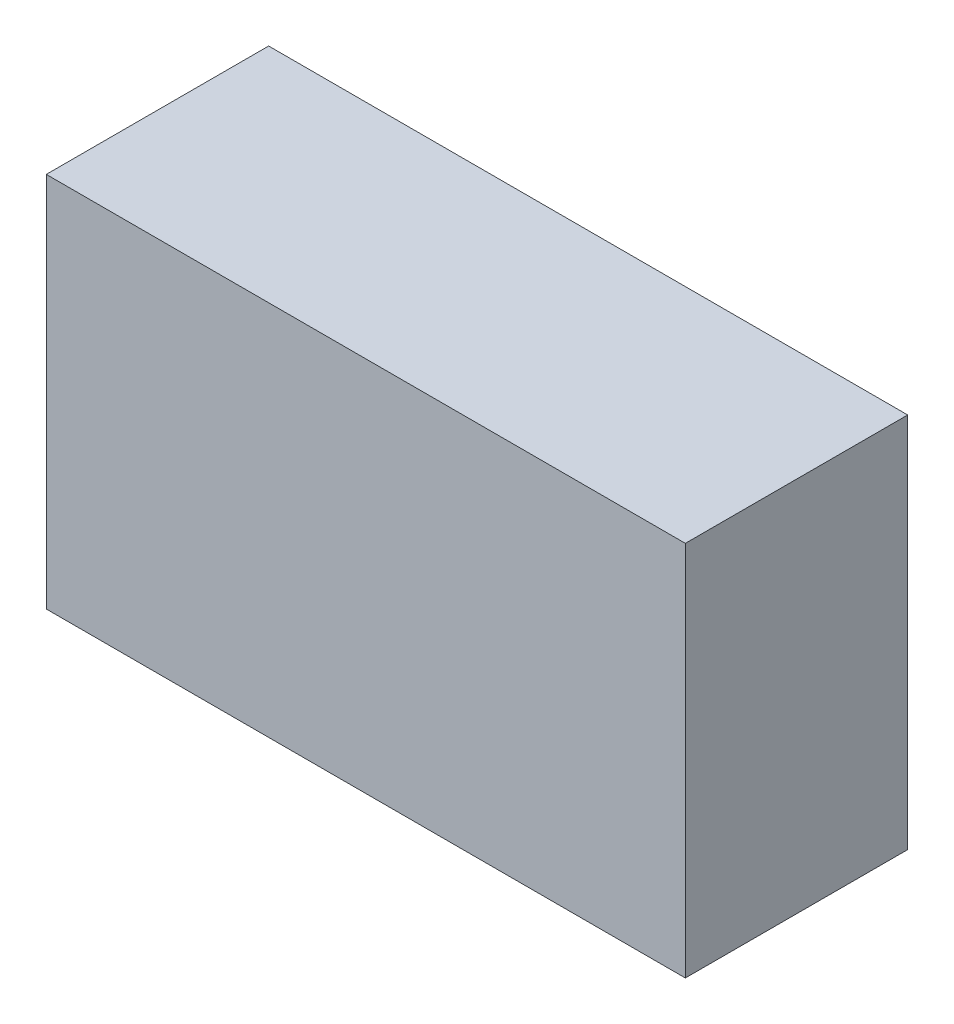
ISO-10303-21;
HEADER;
FILE_DESCRIPTION(('STEP AP214'),'2;1');
FILE_NAME('part.step','',(''),(''),'','','');
FILE_SCHEMA(('AUTOMOTIVE_DESIGN { 1 0 10303 214 1 1 1 1 }'));
ENDSEC;
DATA;
#1=APPLICATION_CONTEXT('core data for automotive mechanical design processes');
#2=APPLICATION_PROTOCOL_DEFINITION('international standard','automotive_design',2000,#1);
#3=PRODUCT_CONTEXT('',#1,'mechanical');
#4=PRODUCT('Part','Part','',(#3));
#5=PRODUCT_RELATED_PRODUCT_CATEGORY('part','',(#4));
#6=PRODUCT_DEFINITION_FORMATION('','',#4);
#7=PRODUCT_DEFINITION_CONTEXT('part definition',#1,'design');
#8=PRODUCT_DEFINITION('design','',#6,#7);
#9=PRODUCT_DEFINITION_SHAPE('','',#8);
#10=(LENGTH_UNIT() NAMED_UNIT(*) SI_UNIT(.MILLI.,.METRE.));
#11=(NAMED_UNIT(*) PLANE_ANGLE_UNIT() SI_UNIT($,.RADIAN.));
#12=(NAMED_UNIT(*) SI_UNIT($,.STERADIAN.) SOLID_ANGLE_UNIT());
#13=UNCERTAINTY_MEASURE_WITH_UNIT(LENGTH_MEASURE(1.E-05),#10,'distance_accuracy_value','');
#14=(GEOMETRIC_REPRESENTATION_CONTEXT(3) GLOBAL_UNCERTAINTY_ASSIGNED_CONTEXT((#13)) GLOBAL_UNIT_ASSIGNED_CONTEXT((#10,
#11,#12)) REPRESENTATION_CONTEXT('',''));
#15=CARTESIAN_POINT('',(0.,0.,0.));
#16=DIRECTION('',(0.,0.,1.));
#17=DIRECTION('',(1.,0.,0.));
#18=AXIS2_PLACEMENT_3D('',#15,#16,#17);
#19=CARTESIAN_POINT('',(-0.364998,0.21500084,0.));
#20=DIRECTION('',(1.,0.,0.));
#21=DIRECTION('',(0.,-1.,0.));
#22=AXIS2_PLACEMENT_3D('',#19,#20,#21);
#23=PLANE('',#22);
#24=DIRECTION('',(0.,-1.,0.));
#25=VECTOR('',#24,1.);
#26=CARTESIAN_POINT('',(-0.364998,0.21500084,0.));
#27=LINE('',#26,#25);
#28=CARTESIAN_POINT('',(-0.364998,0.21500084,0.));
#29=VERTEX_POINT('',#28);
#30=CARTESIAN_POINT('',(-0.364998,-0.21500084,0.));
#31=VERTEX_POINT('',#30);
#32=EDGE_CURVE('E11',#29,#31,#27,.T.);
#33=ORIENTED_EDGE('',*,*,#32,.T.);
#34=DIRECTION('',(0.,0.,1.));
#35=VECTOR('',#34,1.);
#36=CARTESIAN_POINT('',(-0.364998,-0.21500084,0.));
#37=LINE('',#36,#35);
#38=CARTESIAN_POINT('',(-0.364998,-0.21500084,0.254));
#39=VERTEX_POINT('',#38);
#40=EDGE_CURVE('E24',#31,#39,#37,.T.);
#41=ORIENTED_EDGE('',*,*,#40,.T.);
#42=DIRECTION('',(0.,-1.,0.));
#43=VECTOR('',#42,1.);
#44=CARTESIAN_POINT('',(-0.364998,0.21500084,0.254));
#45=LINE('',#44,#43);
#46=CARTESIAN_POINT('',(-0.364998,0.21500084,0.254));
#47=VERTEX_POINT('',#46);
#48=EDGE_CURVE('E87',#47,#39,#45,.T.);
#49=ORIENTED_EDGE('',*,*,#48,.F.);
#50=DIRECTION('',(0.,0.,1.));
#51=VECTOR('',#50,1.);
#52=CARTESIAN_POINT('',(-0.364998,0.21500084,0.));
#53=LINE('',#52,#51);
#54=EDGE_CURVE('E36',#29,#47,#53,.T.);
#55=ORIENTED_EDGE('',*,*,#54,.F.);
#56=EDGE_LOOP('',(#33,#41,#49,#55));
#57=FACE_BOUND('',#56,.T.);
#58=ADVANCED_FACE('F17',(#57),#23,.F.);
#59=CARTESIAN_POINT('',(-0.364998,-0.21500084,0.));
#60=DIRECTION('',(0.,1.,0.));
#61=DIRECTION('',(1.,0.,0.));
#62=AXIS2_PLACEMENT_3D('',#59,#60,#61);
#63=PLANE('',#62);
#64=DIRECTION('',(1.,0.,0.));
#65=VECTOR('',#64,1.);
#66=CARTESIAN_POINT('',(-0.364998,-0.21500084,0.));
#67=LINE('',#66,#65);
#68=CARTESIAN_POINT('',(0.36500054,-0.21500084,0.));
#69=VERTEX_POINT('',#68);
#70=EDGE_CURVE('E84',#31,#69,#67,.T.);
#71=ORIENTED_EDGE('',*,*,#70,.T.);
#72=DIRECTION('',(0.,0.,1.));
#73=VECTOR('',#72,1.);
#74=CARTESIAN_POINT('',(0.36500054,-0.21500084,0.));
#75=LINE('',#74,#73);
#76=CARTESIAN_POINT('',(0.36500054,-0.21500084,0.254));
#77=VERTEX_POINT('',#76);
#78=EDGE_CURVE('E82',#69,#77,#75,.T.);
#79=ORIENTED_EDGE('',*,*,#78,.T.);
#80=DIRECTION('',(1.,0.,0.));
#81=VECTOR('',#80,1.);
#82=CARTESIAN_POINT('',(-0.364998,-0.21500084,0.254));
#83=LINE('',#82,#81);
#84=EDGE_CURVE('E62',#39,#77,#83,.T.);
#85=ORIENTED_EDGE('',*,*,#84,.F.);
#86=ORIENTED_EDGE('',*,*,#40,.F.);
#87=EDGE_LOOP('',(#71,#79,#85,#86));
#88=FACE_BOUND('',#87,.T.);
#89=ADVANCED_FACE('F89',(#88),#63,.F.);
#90=CARTESIAN_POINT('',(0.36500054,-0.21500084,0.));
#91=DIRECTION('',(-1.,0.,0.));
#92=DIRECTION('',(0.,1.,0.));
#93=AXIS2_PLACEMENT_3D('',#90,#91,#92);
#94=PLANE('',#93);
#95=DIRECTION('',(0.,1.,0.));
#96=VECTOR('',#95,1.);
#97=CARTESIAN_POINT('',(0.36500054,-0.21500084,0.));
#98=LINE('',#97,#96);
#99=CARTESIAN_POINT('',(0.36500054,0.21500084,0.));
#100=VERTEX_POINT('',#99);
#101=EDGE_CURVE('E71',#69,#100,#98,.T.);
#102=ORIENTED_EDGE('',*,*,#101,.T.);
#103=DIRECTION('',(0.,0.,1.));
#104=VECTOR('',#103,1.);
#105=CARTESIAN_POINT('',(0.36500054,0.21500084,0.));
#106=LINE('',#105,#104);
#107=CARTESIAN_POINT('',(0.36500054,0.21500084,0.254));
#108=VERTEX_POINT('',#107);
#109=EDGE_CURVE('E65',#100,#108,#106,.T.);
#110=ORIENTED_EDGE('',*,*,#109,.T.);
#111=DIRECTION('',(0.,1.,0.));
#112=VECTOR('',#111,1.);
#113=CARTESIAN_POINT('',(0.36500054,-0.21500084,0.254));
#114=LINE('',#113,#112);
#115=EDGE_CURVE('E57',#77,#108,#114,.T.);
#116=ORIENTED_EDGE('',*,*,#115,.F.);
#117=ORIENTED_EDGE('',*,*,#78,.F.);
#118=EDGE_LOOP('',(#102,#110,#116,#117));
#119=FACE_BOUND('',#118,.T.);
#120=ADVANCED_FACE('F69',(#119),#94,.F.);
#121=CARTESIAN_POINT('',(0.36500054,0.21500084,0.));
#122=DIRECTION('',(0.,-1.,0.));
#123=DIRECTION('',(-1.,0.,0.));
#124=AXIS2_PLACEMENT_3D('',#121,#122,#123);
#125=PLANE('',#124);
#126=DIRECTION('',(-1.,0.,0.));
#127=VECTOR('',#126,1.);
#128=CARTESIAN_POINT('',(0.36500054,0.21500084,0.));
#129=LINE('',#128,#127);
#130=EDGE_CURVE('E66',#100,#29,#129,.T.);
#131=ORIENTED_EDGE('',*,*,#130,.T.);
#132=ORIENTED_EDGE('',*,*,#54,.T.);
#133=DIRECTION('',(-1.,0.,0.));
#134=VECTOR('',#133,1.);
#135=CARTESIAN_POINT('',(0.36500054,0.21500084,0.254));
#136=LINE('',#135,#134);
#137=EDGE_CURVE('E61',#108,#47,#136,.T.);
#138=ORIENTED_EDGE('',*,*,#137,.F.);
#139=ORIENTED_EDGE('',*,*,#109,.F.);
#140=EDGE_LOOP('',(#131,#132,#138,#139));
#141=FACE_BOUND('',#140,.T.);
#142=ADVANCED_FACE('F76',(#141),#125,.F.);
#143=CARTESIAN_POINT('',(-0.364998,0.21500084,0.));
#144=DIRECTION('',(0.,0.,-1.));
#145=DIRECTION('',(-1.,0.,0.));
#146=AXIS2_PLACEMENT_3D('',#143,#144,#145);
#147=PLANE('',#146);
#148=ORIENTED_EDGE('',*,*,#130,.F.);
#149=ORIENTED_EDGE('',*,*,#101,.F.);
#150=ORIENTED_EDGE('',*,*,#70,.F.);
#151=ORIENTED_EDGE('',*,*,#32,.F.);
#152=EDGE_LOOP('',(#148,#149,#150,#151));
#153=FACE_BOUND('',#152,.T.);
#154=ADVANCED_FACE('F91',(#153),#147,.T.);
#155=CARTESIAN_POINT('',(-0.364998,0.21500084,0.254));
#156=DIRECTION('',(0.,0.,-1.));
#157=DIRECTION('',(-1.,0.,0.));
#158=AXIS2_PLACEMENT_3D('',#155,#156,#157);
#159=PLANE('',#158);
#160=ORIENTED_EDGE('',*,*,#48,.T.);
#161=ORIENTED_EDGE('',*,*,#84,.T.);
#162=ORIENTED_EDGE('',*,*,#115,.T.);
#163=ORIENTED_EDGE('',*,*,#137,.T.);
#164=EDGE_LOOP('',(#160,#161,#162,#163));
#165=FACE_BOUND('',#164,.T.);
#166=ADVANCED_FACE('F59',(#165),#159,.F.);
#167=CLOSED_SHELL('',(#58,#89,#120,#142,#154,#166));
#168=MANIFOLD_SOLID_BREP('B1',#167);
#169=ADVANCED_BREP_SHAPE_REPRESENTATION('',(#18,#168),#14);
#170=SHAPE_DEFINITION_REPRESENTATION(#9,#169);
ENDSEC;
END-ISO-10303-21;
